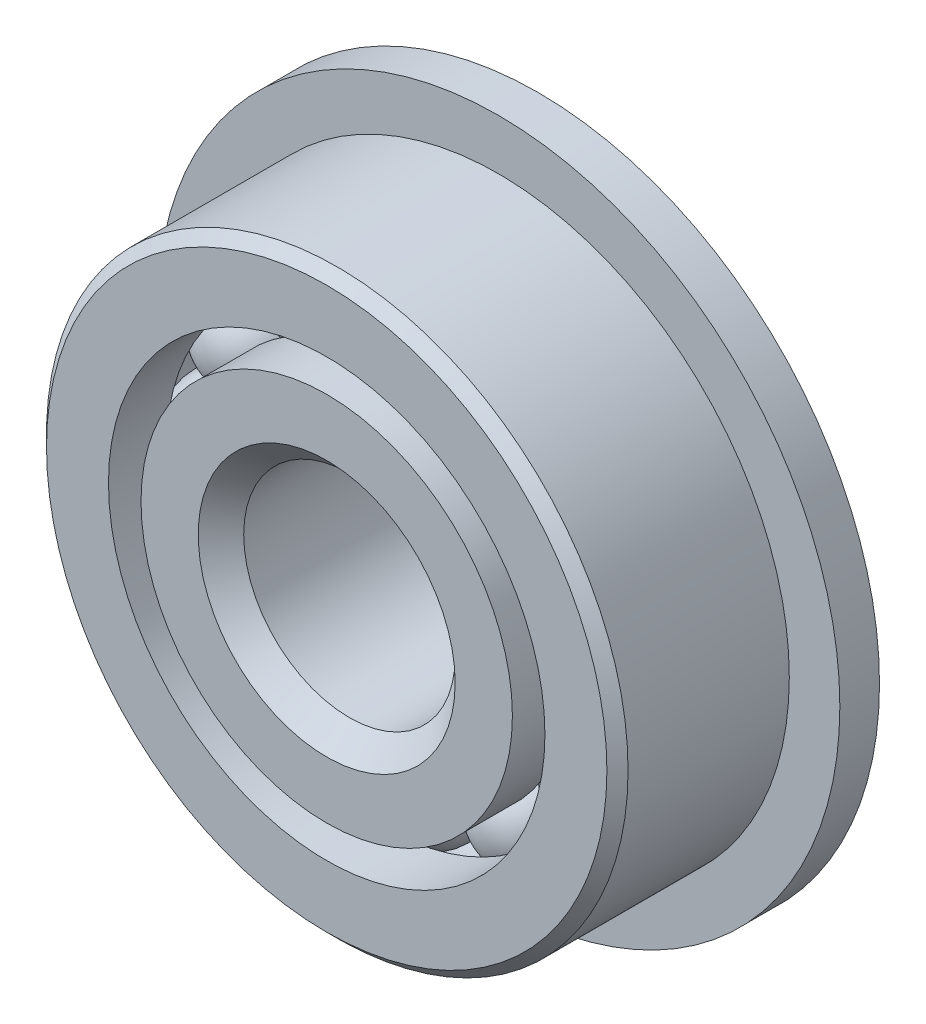
ISO-10303-21;
HEADER;
FILE_DESCRIPTION(('STEP AP214'),'2;1');
FILE_NAME('part.step','',(''),(''),'','','');
FILE_SCHEMA(('AUTOMOTIVE_DESIGN { 1 0 10303 214 1 1 1 1 }'));
ENDSEC;
DATA;
#1=APPLICATION_CONTEXT('core data for automotive mechanical design processes');
#2=APPLICATION_PROTOCOL_DEFINITION('international standard','automotive_design',2000,#1);
#3=PRODUCT_CONTEXT('',#1,'mechanical');
#4=PRODUCT('Part','Part','',(#3));
#5=PRODUCT_RELATED_PRODUCT_CATEGORY('part','',(#4));
#6=PRODUCT_DEFINITION_FORMATION('','',#4);
#7=PRODUCT_DEFINITION_CONTEXT('part definition',#1,'design');
#8=PRODUCT_DEFINITION('design','',#6,#7);
#9=PRODUCT_DEFINITION_SHAPE('','',#8);
#10=(LENGTH_UNIT() NAMED_UNIT(*) SI_UNIT(.MILLI.,.METRE.));
#11=(NAMED_UNIT(*) PLANE_ANGLE_UNIT() SI_UNIT($,.RADIAN.));
#12=(NAMED_UNIT(*) SI_UNIT($,.STERADIAN.) SOLID_ANGLE_UNIT());
#13=UNCERTAINTY_MEASURE_WITH_UNIT(LENGTH_MEASURE(1.E-05),#10,'distance_accuracy_value','');
#14=(GEOMETRIC_REPRESENTATION_CONTEXT(3) GLOBAL_UNCERTAINTY_ASSIGNED_CONTEXT((#13)) GLOBAL_UNIT_ASSIGNED_CONTEXT((#10,
#11,#12)) REPRESENTATION_CONTEXT('',''));
#15=CARTESIAN_POINT('',(0.,0.,0.));
#16=DIRECTION('',(0.,0.,1.));
#17=DIRECTION('',(1.,0.,0.));
#18=AXIS2_PLACEMENT_3D('',#15,#16,#17);
#19=CARTESIAN_POINT('',(-3.03212499999993,5.25179455489982,0.));
#20=DIRECTION('',(0.,0.,1.));
#21=DIRECTION('',(-0.499999999999989,0.866025403784445,0.));
#22=AXIS2_PLACEMENT_3D('',#19,#20,#21);
#23=SPHERICAL_SURFACE('',#22,1.524);
#24=CARTESIAN_POINT('',(-3.03212499999993,5.25179455489982,1.524));
#25=VERTEX_POINT('',#24);
#26=VERTEX_LOOP('',#25);
#27=FACE_BOUND('',#26,.T.);
#28=ADVANCED_FACE('F37',(#27),#23,.T.);
#29=CLOSED_SHELL('',(#28));
#30=MANIFOLD_SOLID_BREP('B2',#29);
#31=CARTESIAN_POINT('',(-5.25179455489975,3.03212500000006,0.));
#32=DIRECTION('',(0.,0.,1.));
#33=DIRECTION('',(-0.866025403784433,0.50000000000001,0.));
#34=AXIS2_PLACEMENT_3D('',#31,#32,#33);
#35=SPHERICAL_SURFACE('',#34,1.524);
#36=CARTESIAN_POINT('',(-5.25179455489975,3.03212500000006,1.524));
#37=VERTEX_POINT('',#36);
#38=VERTEX_LOOP('',#37);
#39=FACE_BOUND('',#38,.T.);
#40=ADVANCED_FACE('F68',(#39),#35,.T.);
#41=CLOSED_SHELL('',(#40));
#42=MANIFOLD_SOLID_BREP('B6',#41);
#43=CARTESIAN_POINT('',(-6.06425,0.,0.));
#44=DIRECTION('',(0.,0.,1.));
#45=DIRECTION('',(-1.,0.,0.));
#46=AXIS2_PLACEMENT_3D('',#43,#44,#45);
#47=SPHERICAL_SURFACE('',#46,1.524);
#48=CARTESIAN_POINT('',(-6.06425,0.,1.524));
#49=VERTEX_POINT('',#48);
#50=VERTEX_LOOP('',#49);
#51=FACE_BOUND('',#50,.T.);
#52=ADVANCED_FACE('F99',(#51),#47,.T.);
#53=CLOSED_SHELL('',(#52));
#54=MANIFOLD_SOLID_BREP('B33',#53);
#55=CARTESIAN_POINT('',(-5.25179455489981,-3.03212499999995,0.));
#56=DIRECTION('',(0.,0.,1.));
#57=DIRECTION('',(-0.866025403784443,-0.499999999999992,0.));
#58=AXIS2_PLACEMENT_3D('',#55,#56,#57);
#59=SPHERICAL_SURFACE('',#58,1.524);
#60=CARTESIAN_POINT('',(-5.25179455489981,-3.03212499999995,1.524));
#61=VERTEX_POINT('',#60);
#62=VERTEX_LOOP('',#61);
#63=FACE_BOUND('',#62,.T.);
#64=ADVANCED_FACE('F128',(#63),#59,.T.);
#65=CLOSED_SHELL('',(#64));
#66=MANIFOLD_SOLID_BREP('B64',#65);
#67=CARTESIAN_POINT('',(-3.03212500000004,-5.25179455489976,0.));
#68=DIRECTION('',(0.,0.,1.));
#69=DIRECTION('',(-0.500000000000007,-0.866025403784435,0.));
#70=AXIS2_PLACEMENT_3D('',#67,#68,#69);
#71=SPHERICAL_SURFACE('',#70,1.524);
#72=CARTESIAN_POINT('',(-3.03212500000004,-5.25179455489976,1.524));
#73=VERTEX_POINT('',#72);
#74=VERTEX_LOOP('',#73);
#75=FACE_BOUND('',#74,.T.);
#76=ADVANCED_FACE('F157',(#75),#71,.T.);
#77=CLOSED_SHELL('',(#76));
#78=MANIFOLD_SOLID_BREP('B95',#77);
#79=CARTESIAN_POINT('',(0.,-6.06425,0.));
#80=DIRECTION('',(0.,0.,1.));
#81=DIRECTION('',(0.,-1.,0.));
#82=AXIS2_PLACEMENT_3D('',#79,#80,#81);
#83=SPHERICAL_SURFACE('',#82,1.524);
#84=CARTESIAN_POINT('',(0.,-6.06425,1.524));
#85=VERTEX_POINT('',#84);
#86=VERTEX_LOOP('',#85);
#87=FACE_BOUND('',#86,.T.);
#88=ADVANCED_FACE('F186',(#87),#83,.T.);
#89=CLOSED_SHELL('',(#88));
#90=MANIFOLD_SOLID_BREP('B124',#89);
#91=CARTESIAN_POINT('',(3.03212499999997,-5.2517945548998,0.));
#92=DIRECTION('',(0.,0.,1.));
#93=DIRECTION('',(0.499999999999995,-0.866025403784442,0.));
#94=AXIS2_PLACEMENT_3D('',#91,#92,#93);
#95=SPHERICAL_SURFACE('',#94,1.524);
#96=CARTESIAN_POINT('',(3.03212499999997,-5.2517945548998,1.524));
#97=VERTEX_POINT('',#96);
#98=VERTEX_LOOP('',#97);
#99=FACE_BOUND('',#98,.T.);
#100=ADVANCED_FACE('F215',(#99),#95,.T.);
#101=CLOSED_SHELL('',(#100));
#102=MANIFOLD_SOLID_BREP('B153',#101);
#103=CARTESIAN_POINT('',(5.25179455489977,-3.03212500000002,0.));
#104=DIRECTION('',(0.,0.,1.));
#105=DIRECTION('',(0.866025403784436,-0.500000000000004,0.));
#106=AXIS2_PLACEMENT_3D('',#103,#104,#105);
#107=SPHERICAL_SURFACE('',#106,1.524);
#108=CARTESIAN_POINT('',(5.25179455489977,-3.03212500000002,1.524));
#109=VERTEX_POINT('',#108);
#110=VERTEX_LOOP('',#109);
#111=FACE_BOUND('',#110,.T.);
#112=ADVANCED_FACE('F244',(#111),#107,.T.);
#113=CLOSED_SHELL('',(#112));
#114=MANIFOLD_SOLID_BREP('B182',#113);
#115=CARTESIAN_POINT('',(6.06425,0.,0.));
#116=DIRECTION('',(0.,0.,1.));
#117=DIRECTION('',(1.,0.,0.));
#118=AXIS2_PLACEMENT_3D('',#115,#116,#117);
#119=SPHERICAL_SURFACE('',#118,1.524);
#120=CARTESIAN_POINT('',(6.06425,0.,1.524));
#121=VERTEX_POINT('',#120);
#122=VERTEX_LOOP('',#121);
#123=FACE_BOUND('',#122,.T.);
#124=ADVANCED_FACE('F273',(#123),#119,.T.);
#125=CLOSED_SHELL('',(#124));
#126=MANIFOLD_SOLID_BREP('B211',#125);
#127=CARTESIAN_POINT('',(5.25179455489979,3.03212499999999,0.));
#128=DIRECTION('',(0.,0.,1.));
#129=DIRECTION('',(0.86602540378444,0.499999999999998,0.));
#130=AXIS2_PLACEMENT_3D('',#127,#128,#129);
#131=SPHERICAL_SURFACE('',#130,1.524);
#132=CARTESIAN_POINT('',(5.25179455489979,3.03212499999999,1.524));
#133=VERTEX_POINT('',#132);
#134=VERTEX_LOOP('',#133);
#135=FACE_BOUND('',#134,.T.);
#136=ADVANCED_FACE('F302',(#135),#131,.T.);
#137=CLOSED_SHELL('',(#136));
#138=MANIFOLD_SOLID_BREP('B240',#137);
#139=CARTESIAN_POINT('',(3.03212500000001,5.25179455489978,0.));
#140=DIRECTION('',(0.,0.,1.));
#141=DIRECTION('',(0.500000000000001,0.866025403784438,0.));
#142=AXIS2_PLACEMENT_3D('',#139,#140,#141);
#143=SPHERICAL_SURFACE('',#142,1.524);
#144=CARTESIAN_POINT('',(3.03212500000001,5.25179455489978,1.524));
#145=VERTEX_POINT('',#144);
#146=VERTEX_LOOP('',#145);
#147=FACE_BOUND('',#146,.T.);
#148=ADVANCED_FACE('F331',(#147),#143,.T.);
#149=CLOSED_SHELL('',(#148));
#150=MANIFOLD_SOLID_BREP('B269',#149);
#151=CARTESIAN_POINT('',(0.,6.06425,0.));
#152=DIRECTION('',(0.,0.,1.));
#153=DIRECTION('',(0.,1.,0.));
#154=AXIS2_PLACEMENT_3D('',#151,#152,#153);
#155=SPHERICAL_SURFACE('',#154,1.524);
#156=CARTESIAN_POINT('',(0.,6.06425,1.524));
#157=VERTEX_POINT('',#156);
#158=VERTEX_LOOP('',#157);
#159=FACE_BOUND('',#158,.T.);
#160=ADVANCED_FACE('F364',(#159),#155,.T.);
#161=CLOSED_SHELL('',(#160));
#162=MANIFOLD_SOLID_BREP('B298',#161);
#163=CARTESIAN_POINT('',(0.,0.,3.175));
#164=DIRECTION('',(0.,0.,1.));
#165=DIRECTION('',(1.,0.,0.));
#166=AXIS2_PLACEMENT_3D('',#163,#164,#165);
#167=CYLINDRICAL_SURFACE('',#166,5.57578846153846);
#168=CARTESIAN_POINT('',(0.,0.,-1.44360012657376));
#169=DIRECTION('',(0.,0.,1.));
#170=DIRECTION('',(1.,0.,0.));
#171=AXIS2_PLACEMENT_3D('',#168,#169,#170);
#172=CIRCLE('',#171,5.57578846153846);
#173=CARTESIAN_POINT('',(5.57578846153846,0.,-1.44360012657376));
#174=VERTEX_POINT('',#173);
#175=EDGE_CURVE('E394',#174,#174,#172,.T.);
#176=ORIENTED_EDGE('',*,*,#175,.F.);
#177=EDGE_LOOP('',(#176));
#178=FACE_BOUND('',#177,.T.);
#179=CARTESIAN_POINT('',(0.,0.,-4.7625));
#180=DIRECTION('',(0.,0.,1.));
#181=DIRECTION('',(1.,0.,0.));
#182=AXIS2_PLACEMENT_3D('',#179,#180,#181);
#183=CIRCLE('',#182,5.57578846153846);
#184=CARTESIAN_POINT('',(5.57578846153846,0.,-4.7625));
#185=VERTEX_POINT('',#184);
#186=EDGE_CURVE('E398',#185,#185,#183,.T.);
#187=ORIENTED_EDGE('',*,*,#186,.T.);
#188=EDGE_LOOP('',(#187));
#189=FACE_BOUND('',#188,.T.);
#190=ADVANCED_FACE('F383',(#178,#189),#167,.T.);
#191=CARTESIAN_POINT('',(0.,3.4925,-4.7625));
#192=DIRECTION('',(0.,0.,1.));
#193=DIRECTION('',(1.,0.,0.));
#194=AXIS2_PLACEMENT_3D('',#191,#192,#193);
#195=PLANE('',#194);
#196=ORIENTED_EDGE('',*,*,#186,.F.);
#197=EDGE_LOOP('',(#196));
#198=FACE_BOUND('',#197,.T.);
#199=CARTESIAN_POINT('',(0.,0.,-4.7625));
#200=DIRECTION('',(0.,0.,1.));
#201=DIRECTION('',(1.,0.,0.));
#202=AXIS2_PLACEMENT_3D('',#199,#200,#201);
#203=CIRCLE('',#202,3.4925);
#204=CARTESIAN_POINT('',(3.4925,0.,-4.7625));
#205=VERTEX_POINT('',#204);
#206=EDGE_CURVE('E403',#205,#205,#203,.T.);
#207=ORIENTED_EDGE('',*,*,#206,.T.);
#208=EDGE_LOOP('',(#207));
#209=FACE_BOUND('',#208,.T.);
#210=ADVANCED_FACE('F430',(#198,#209),#195,.F.);
#211=CARTESIAN_POINT('',(0.,0.,-4.445));
#212=DIRECTION('',(0.,0.,-1.));
#213=DIRECTION('',(-1.,0.,0.));
#214=AXIS2_PLACEMENT_3D('',#211,#212,#213);
#215=CONICAL_SURFACE('',#214,3.175,0.785398163397443);
#216=ORIENTED_EDGE('',*,*,#206,.F.);
#217=EDGE_LOOP('',(#216));
#218=FACE_BOUND('',#217,.T.);
#219=CARTESIAN_POINT('',(0.,0.,-4.445));
#220=DIRECTION('',(0.,0.,1.));
#221=DIRECTION('',(1.,0.,0.));
#222=AXIS2_PLACEMENT_3D('',#219,#220,#221);
#223=CIRCLE('',#222,3.175);
#224=CARTESIAN_POINT('',(3.175,0.,-4.445));
#225=VERTEX_POINT('',#224);
#226=EDGE_CURVE('E406',#225,#225,#223,.T.);
#227=ORIENTED_EDGE('',*,*,#226,.T.);
#228=EDGE_LOOP('',(#227));
#229=FACE_BOUND('',#228,.T.);
#230=ADVANCED_FACE('F436',(#218,#229),#215,.F.);
#231=CARTESIAN_POINT('',(0.,0.,3.175));
#232=DIRECTION('',(0.,0.,1.));
#233=DIRECTION('',(1.,0.,0.));
#234=AXIS2_PLACEMENT_3D('',#231,#232,#233);
#235=CYLINDRICAL_SURFACE('',#234,3.175);
#236=ORIENTED_EDGE('',*,*,#226,.F.);
#237=EDGE_LOOP('',(#236));
#238=FACE_BOUND('',#237,.T.);
#239=CARTESIAN_POINT('',(0.,0.,2.492375));
#240=DIRECTION('',(0.,0.,1.));
#241=DIRECTION('',(1.,0.,0.));
#242=AXIS2_PLACEMENT_3D('',#239,#240,#241);
#243=CIRCLE('',#242,3.175);
#244=CARTESIAN_POINT('',(3.175,0.,2.492375));
#245=VERTEX_POINT('',#244);
#246=EDGE_CURVE('E409',#245,#245,#243,.T.);
#247=ORIENTED_EDGE('',*,*,#246,.T.);
#248=EDGE_LOOP('',(#247));
#249=FACE_BOUND('',#248,.T.);
#250=ADVANCED_FACE('F426',(#238,#249),#235,.F.);
#251=CARTESIAN_POINT('',(0.,0.,3.175));
#252=DIRECTION('',(0.,0.,1.));
#253=DIRECTION('',(1.,0.,0.));
#254=AXIS2_PLACEMENT_3D('',#251,#252,#253);
#255=CONICAL_SURFACE('',#254,3.857625,0.78539816339745);
#256=ORIENTED_EDGE('',*,*,#246,.F.);
#257=EDGE_LOOP('',(#256));
#258=FACE_BOUND('',#257,.T.);
#259=CARTESIAN_POINT('',(0.,0.,3.175));
#260=DIRECTION('',(0.,0.,1.));
#261=DIRECTION('',(1.,0.,0.));
#262=AXIS2_PLACEMENT_3D('',#259,#260,#261);
#263=CIRCLE('',#262,3.857625);
#264=CARTESIAN_POINT('',(3.857625,0.,3.175));
#265=VERTEX_POINT('',#264);
#266=EDGE_CURVE('E412',#265,#265,#263,.T.);
#267=ORIENTED_EDGE('',*,*,#266,.T.);
#268=EDGE_LOOP('',(#267));
#269=FACE_BOUND('',#268,.T.);
#270=ADVANCED_FACE('F416',(#258,#269),#255,.F.);
#271=CARTESIAN_POINT('',(0.,5.57578846153846,3.175));
#272=DIRECTION('',(0.,0.,-1.));
#273=DIRECTION('',(-1.,0.,0.));
#274=AXIS2_PLACEMENT_3D('',#271,#272,#273);
#275=PLANE('',#274);
#276=CARTESIAN_POINT('',(0.,0.,3.175));
#277=DIRECTION('',(0.,0.,1.));
#278=DIRECTION('',(1.,0.,0.));
#279=AXIS2_PLACEMENT_3D('',#276,#277,#278);
#280=CIRCLE('',#279,5.57578846153846);
#281=CARTESIAN_POINT('',(5.57578846153846,0.,3.175));
#282=VERTEX_POINT('',#281);
#283=EDGE_CURVE('E390',#282,#282,#280,.T.);
#284=ORIENTED_EDGE('',*,*,#283,.T.);
#285=EDGE_LOOP('',(#284));
#286=FACE_BOUND('',#285,.T.);
#287=ORIENTED_EDGE('',*,*,#266,.F.);
#288=EDGE_LOOP('',(#287));
#289=FACE_BOUND('',#288,.T.);
#290=ADVANCED_FACE('F385',(#286,#289),#275,.F.);
#291=CARTESIAN_POINT('',(0.,0.,0.));
#292=DIRECTION('',(0.,0.,1.));
#293=DIRECTION('',(1.,0.,0.));
#294=AXIS2_PLACEMENT_3D('',#291,#292,#293);
#295=TOROIDAL_SURFACE('',#294,6.06425,1.524);
#296=CARTESIAN_POINT('',(0.,0.,1.44360012657376));
#297=DIRECTION('',(0.,0.,1.));
#298=DIRECTION('',(1.,0.,0.));
#299=AXIS2_PLACEMENT_3D('',#296,#297,#298);
#300=CIRCLE('',#299,5.57578846153846);
#301=CARTESIAN_POINT('',(5.57578846153846,0.,1.44360012657376));
#302=VERTEX_POINT('',#301);
#303=EDGE_CURVE('E363',#302,#302,#300,.T.);
#304=ORIENTED_EDGE('',*,*,#303,.F.);
#305=EDGE_LOOP('',(#304));
#306=FACE_BOUND('',#305,.T.);
#307=ORIENTED_EDGE('',*,*,#175,.T.);
#308=EDGE_LOOP('',(#307));
#309=FACE_BOUND('',#308,.T.);
#310=ADVANCED_FACE('F419',(#306,#309),#295,.F.);
#311=CARTESIAN_POINT('',(0.,0.,3.175));
#312=DIRECTION('',(0.,0.,1.));
#313=DIRECTION('',(1.,0.,0.));
#314=AXIS2_PLACEMENT_3D('',#311,#312,#313);
#315=CYLINDRICAL_SURFACE('',#314,5.57578846153846);
#316=ORIENTED_EDGE('',*,*,#283,.F.);
#317=EDGE_LOOP('',(#316));
#318=FACE_BOUND('',#317,.T.);
#319=ORIENTED_EDGE('',*,*,#303,.T.);
#320=EDGE_LOOP('',(#319));
#321=FACE_BOUND('',#320,.T.);
#322=ADVANCED_FACE('F424',(#318,#321),#315,.T.);
#323=CLOSED_SHELL('',(#190,#210,#230,#250,#270,#290,#310,#322));
#324=MANIFOLD_SOLID_BREP('B327',#323);
#325=CARTESIAN_POINT('',(0.,0.,2.8575));
#326=DIRECTION('',(0.,0.,-1.));
#327=DIRECTION('',(-1.,0.,0.));
#328=AXIS2_PLACEMENT_3D('',#325,#326,#327);
#329=CONICAL_SURFACE('',#328,8.73125,0.785398163397446);
#330=CARTESIAN_POINT('',(0.,0.,3.175));
#331=DIRECTION('',(0.,0.,1.));
#332=DIRECTION('',(1.,0.,0.));
#333=AXIS2_PLACEMENT_3D('',#330,#331,#332);
#334=CIRCLE('',#333,8.41375);
#335=CARTESIAN_POINT('',(8.41375,0.,3.175));
#336=VERTEX_POINT('',#335);
#337=EDGE_CURVE('E532',#336,#336,#334,.T.);
#338=ORIENTED_EDGE('',*,*,#337,.F.);
#339=EDGE_LOOP('',(#338));
#340=FACE_BOUND('',#339,.T.);
#341=CARTESIAN_POINT('',(0.,0.,2.8575));
#342=DIRECTION('',(0.,0.,1.));
#343=DIRECTION('',(1.,0.,0.));
#344=AXIS2_PLACEMENT_3D('',#341,#342,#343);
#345=CIRCLE('',#344,8.73125);
#346=CARTESIAN_POINT('',(8.73125,0.,2.8575));
#347=VERTEX_POINT('',#346);
#348=EDGE_CURVE('E382',#347,#347,#345,.T.);
#349=ORIENTED_EDGE('',*,*,#348,.T.);
#350=EDGE_LOOP('',(#349));
#351=FACE_BOUND('',#350,.T.);
#352=ADVANCED_FACE('F510',(#340,#351),#329,.T.);
#353=CARTESIAN_POINT('',(0.,0.,3.175));
#354=DIRECTION('',(0.,0.,1.));
#355=DIRECTION('',(1.,0.,0.));
#356=AXIS2_PLACEMENT_3D('',#353,#354,#355);
#357=CYLINDRICAL_SURFACE('',#356,8.73125);
#358=CARTESIAN_POINT('',(0.,0.,-1.984375));
#359=DIRECTION('',(0.,0.,1.));
#360=DIRECTION('',(1.,0.,0.));
#361=AXIS2_PLACEMENT_3D('',#358,#359,#360);
#362=CIRCLE('',#361,8.73125);
#363=CARTESIAN_POINT('',(8.73125,0.,-1.984375));
#364=VERTEX_POINT('',#363);
#365=EDGE_CURVE('E513',#364,#364,#362,.T.);
#366=ORIENTED_EDGE('',*,*,#365,.T.);
#367=EDGE_LOOP('',(#366));
#368=FACE_BOUND('',#367,.T.);
#369=ORIENTED_EDGE('',*,*,#348,.F.);
#370=EDGE_LOOP('',(#369));
#371=FACE_BOUND('',#370,.T.);
#372=ADVANCED_FACE('F553',(#368,#371),#357,.T.);
#373=CARTESIAN_POINT('',(0.,8.41375,-3.175));
#374=DIRECTION('',(0.,0.,1.));
#375=DIRECTION('',(1.,0.,0.));
#376=AXIS2_PLACEMENT_3D('',#373,#374,#375);
#377=PLANE('',#376);
#378=CARTESIAN_POINT('',(0.,0.,-3.175));
#379=DIRECTION('',(0.,0.,1.));
#380=DIRECTION('',(1.,0.,0.));
#381=AXIS2_PLACEMENT_3D('',#378,#379,#380);
#382=CIRCLE('',#381,6.55271153846154);
#383=CARTESIAN_POINT('',(6.55271153846154,0.,-3.175));
#384=VERTEX_POINT('',#383);
#385=EDGE_CURVE('E517',#384,#384,#382,.T.);
#386=ORIENTED_EDGE('',*,*,#385,.T.);
#387=EDGE_LOOP('',(#386));
#388=FACE_BOUND('',#387,.T.);
#389=CARTESIAN_POINT('',(0.,0.,-3.175));
#390=DIRECTION('',(0.,0.,-1.));
#391=DIRECTION('',(-1.,0.,0.));
#392=AXIS2_PLACEMENT_3D('',#389,#390,#391);
#393=CIRCLE('',#392,10.2489);
#394=CARTESIAN_POINT('',(-10.2489,0.,-3.175));
#395=VERTEX_POINT('',#394);
#396=EDGE_CURVE('E535',#395,#395,#393,.T.);
#397=ORIENTED_EDGE('',*,*,#396,.T.);
#398=EDGE_LOOP('',(#397));
#399=FACE_BOUND('',#398,.T.);
#400=ADVANCED_FACE('F556',(#388,#399),#377,.F.);
#401=CARTESIAN_POINT('',(0.,0.,3.175));
#402=DIRECTION('',(0.,0.,1.));
#403=DIRECTION('',(1.,0.,0.));
#404=AXIS2_PLACEMENT_3D('',#401,#402,#403);
#405=CYLINDRICAL_SURFACE('',#404,6.55271153846154);
#406=ORIENTED_EDGE('',*,*,#385,.F.);
#407=EDGE_LOOP('',(#406));
#408=FACE_BOUND('',#407,.T.);
#409=CARTESIAN_POINT('',(0.,0.,-1.44360012657376));
#410=DIRECTION('',(0.,0.,1.));
#411=DIRECTION('',(1.,0.,0.));
#412=AXIS2_PLACEMENT_3D('',#409,#410,#411);
#413=CIRCLE('',#412,6.55271153846154);
#414=CARTESIAN_POINT('',(6.55271153846154,0.,-1.44360012657376));
#415=VERTEX_POINT('',#414);
#416=EDGE_CURVE('E521',#415,#415,#413,.T.);
#417=ORIENTED_EDGE('',*,*,#416,.T.);
#418=EDGE_LOOP('',(#417));
#419=FACE_BOUND('',#418,.T.);
#420=ADVANCED_FACE('F561',(#408,#419),#405,.F.);
#421=CARTESIAN_POINT('',(0.,0.,0.));
#422=DIRECTION('',(0.,0.,1.));
#423=DIRECTION('',(1.,0.,0.));
#424=AXIS2_PLACEMENT_3D('',#421,#422,#423);
#425=TOROIDAL_SURFACE('',#424,6.06425,1.524);
#426=ORIENTED_EDGE('',*,*,#416,.F.);
#427=EDGE_LOOP('',(#426));
#428=FACE_BOUND('',#427,.T.);
#429=CARTESIAN_POINT('',(0.,0.,1.44360012657376));
#430=DIRECTION('',(0.,0.,1.));
#431=DIRECTION('',(1.,0.,0.));
#432=AXIS2_PLACEMENT_3D('',#429,#430,#431);
#433=CIRCLE('',#432,6.55271153846154);
#434=CARTESIAN_POINT('',(6.55271153846154,0.,1.44360012657376));
#435=VERTEX_POINT('',#434);
#436=EDGE_CURVE('E526',#435,#435,#433,.T.);
#437=ORIENTED_EDGE('',*,*,#436,.T.);
#438=EDGE_LOOP('',(#437));
#439=FACE_BOUND('',#438,.T.);
#440=ADVANCED_FACE('F568',(#428,#439),#425,.F.);
#441=CARTESIAN_POINT('',(0.,0.,3.175));
#442=DIRECTION('',(0.,0.,1.));
#443=DIRECTION('',(1.,0.,0.));
#444=AXIS2_PLACEMENT_3D('',#441,#442,#443);
#445=CYLINDRICAL_SURFACE('',#444,6.55271153846154);
#446=ORIENTED_EDGE('',*,*,#436,.F.);
#447=EDGE_LOOP('',(#446));
#448=FACE_BOUND('',#447,.T.);
#449=CARTESIAN_POINT('',(0.,0.,3.175));
#450=DIRECTION('',(0.,0.,1.));
#451=DIRECTION('',(1.,0.,0.));
#452=AXIS2_PLACEMENT_3D('',#449,#450,#451);
#453=CIRCLE('',#452,6.55271153846154);
#454=CARTESIAN_POINT('',(6.55271153846154,0.,3.175));
#455=VERTEX_POINT('',#454);
#456=EDGE_CURVE('E529',#455,#455,#453,.T.);
#457=ORIENTED_EDGE('',*,*,#456,.T.);
#458=EDGE_LOOP('',(#457));
#459=FACE_BOUND('',#458,.T.);
#460=ADVANCED_FACE('F572',(#448,#459),#445,.F.);
#461=CARTESIAN_POINT('',(0.,8.41375,3.175));
#462=DIRECTION('',(0.,0.,-1.));
#463=DIRECTION('',(-1.,0.,0.));
#464=AXIS2_PLACEMENT_3D('',#461,#462,#463);
#465=PLANE('',#464);
#466=ORIENTED_EDGE('',*,*,#456,.F.);
#467=EDGE_LOOP('',(#466));
#468=FACE_BOUND('',#467,.T.);
#469=ORIENTED_EDGE('',*,*,#337,.T.);
#470=EDGE_LOOP('',(#469));
#471=FACE_BOUND('',#470,.T.);
#472=ADVANCED_FACE('F548',(#468,#471),#465,.F.);
#473=CARTESIAN_POINT('',(0.,7.48323076923077,-1.984375));
#474=DIRECTION('',(0.,0.,1.));
#475=DIRECTION('',(1.,0.,0.));
#476=AXIS2_PLACEMENT_3D('',#473,#474,#475);
#477=PLANE('',#476);
#478=CARTESIAN_POINT('',(0.,0.,-1.984375));
#479=DIRECTION('',(0.,0.,-1.));
#480=DIRECTION('',(-1.,0.,0.));
#481=AXIS2_PLACEMENT_3D('',#478,#479,#480);
#482=CIRCLE('',#481,10.2489);
#483=CARTESIAN_POINT('',(-10.2489,0.,-1.984375));
#484=VERTEX_POINT('',#483);
#485=EDGE_CURVE('E538',#484,#484,#482,.T.);
#486=ORIENTED_EDGE('',*,*,#485,.F.);
#487=EDGE_LOOP('',(#486));
#488=FACE_BOUND('',#487,.T.);
#489=ORIENTED_EDGE('',*,*,#365,.F.);
#490=EDGE_LOOP('',(#489));
#491=FACE_BOUND('',#490,.T.);
#492=ADVANCED_FACE('F545',(#488,#491),#477,.T.);
#493=CARTESIAN_POINT('',(0.,0.,-4.7625));
#494=DIRECTION('',(0.,0.,-1.));
#495=DIRECTION('',(-1.,0.,0.));
#496=AXIS2_PLACEMENT_3D('',#493,#494,#495);
#497=CYLINDRICAL_SURFACE('',#496,10.2489);
#498=ORIENTED_EDGE('',*,*,#485,.T.);
#499=EDGE_LOOP('',(#498));
#500=FACE_BOUND('',#499,.T.);
#501=ORIENTED_EDGE('',*,*,#396,.F.);
#502=EDGE_LOOP('',(#501));
#503=FACE_BOUND('',#502,.T.);
#504=ADVANCED_FACE('F542',(#500,#503),#497,.T.);
#505=CLOSED_SHELL('',(#352,#372,#400,#420,#440,#460,#472,#492,#504));
#506=MANIFOLD_SOLID_BREP('B358',#505);
#507=ADVANCED_BREP_SHAPE_REPRESENTATION('',(#18,#30,#42,#54,#66,#78,#90,#102,#114,#126,#138,
#150,#162,#324,#506),#14);
#508=SHAPE_DEFINITION_REPRESENTATION(#9,#507);
ENDSEC;
END-ISO-10303-21;
